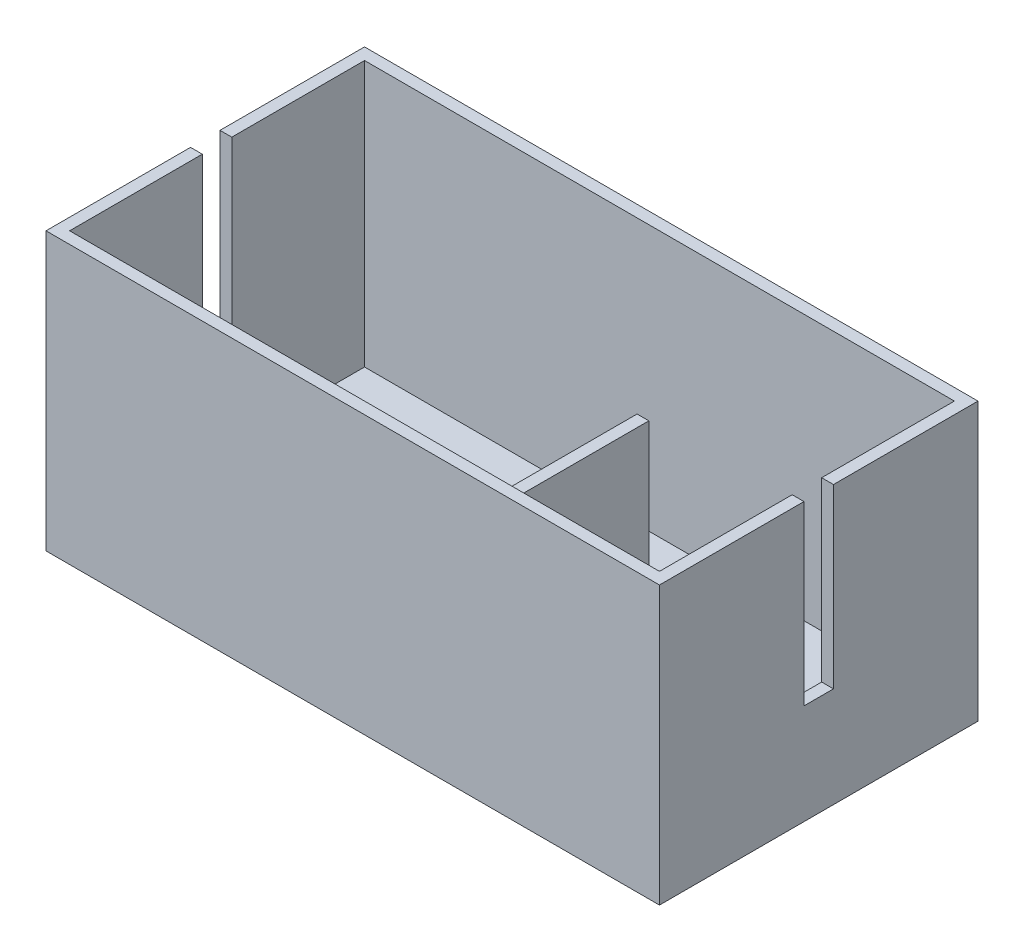
ISO-10303-21;
HEADER;
FILE_DESCRIPTION(('STEP AP214'),'2;1');
FILE_NAME('part.step','',(''),(''),'','','');
FILE_SCHEMA(('AUTOMOTIVE_DESIGN { 1 0 10303 214 1 1 1 1 }'));
ENDSEC;
DATA;
#1=APPLICATION_CONTEXT('core data for automotive mechanical design processes');
#2=APPLICATION_PROTOCOL_DEFINITION('international standard','automotive_design',2000,#1);
#3=PRODUCT_CONTEXT('',#1,'mechanical');
#4=PRODUCT('Part','Part','',(#3));
#5=PRODUCT_RELATED_PRODUCT_CATEGORY('part','',(#4));
#6=PRODUCT_DEFINITION_FORMATION('','',#4);
#7=PRODUCT_DEFINITION_CONTEXT('part definition',#1,'design');
#8=PRODUCT_DEFINITION('design','',#6,#7);
#9=PRODUCT_DEFINITION_SHAPE('','',#8);
#10=(LENGTH_UNIT() NAMED_UNIT(*) SI_UNIT(.MILLI.,.METRE.));
#11=(NAMED_UNIT(*) PLANE_ANGLE_UNIT() SI_UNIT($,.RADIAN.));
#12=(NAMED_UNIT(*) SI_UNIT($,.STERADIAN.) SOLID_ANGLE_UNIT());
#13=UNCERTAINTY_MEASURE_WITH_UNIT(LENGTH_MEASURE(1.E-05),#10,'distance_accuracy_value','');
#14=(GEOMETRIC_REPRESENTATION_CONTEXT(3) GLOBAL_UNCERTAINTY_ASSIGNED_CONTEXT((#13)) GLOBAL_UNIT_ASSIGNED_CONTEXT((#10,
#11,#12)) REPRESENTATION_CONTEXT('',''));
#15=CARTESIAN_POINT('',(0.,0.,0.));
#16=DIRECTION('',(0.,0.,1.));
#17=DIRECTION('',(1.,0.,0.));
#18=AXIS2_PLACEMENT_3D('',#15,#16,#17);
#19=CARTESIAN_POINT('',(-50.,45.,25.));
#20=DIRECTION('',(0.,0.,-1.));
#21=DIRECTION('',(-1.,0.,0.));
#22=AXIS2_PLACEMENT_3D('',#19,#20,#21);
#23=PLANE('',#22);
#24=DIRECTION('',(1.,0.,0.));
#25=VECTOR('',#24,1.);
#26=CARTESIAN_POINT('',(20.,40.,25.));
#27=LINE('',#26,#25);
#28=CARTESIAN_POINT('',(20.,40.,25.));
#29=VERTEX_POINT('',#28);
#30=CARTESIAN_POINT('',(22.,40.,25.));
#31=VERTEX_POINT('',#30);
#32=EDGE_CURVE('E48',#29,#31,#27,.T.);
#33=ORIENTED_EDGE('',*,*,#32,.F.);
#34=DIRECTION('',(0.,-1.,0.));
#35=VECTOR('',#34,1.);
#36=CARTESIAN_POINT('',(20.,40.,25.));
#37=LINE('',#36,#35);
#38=CARTESIAN_POINT('',(20.,0.,25.));
#39=VERTEX_POINT('',#38);
#40=EDGE_CURVE('E199',#29,#39,#37,.T.);
#41=ORIENTED_EDGE('',*,*,#40,.T.);
#42=DIRECTION('',(1.,0.,0.));
#43=VECTOR('',#42,1.);
#44=CARTESIAN_POINT('',(-50.,0.,25.));
#45=LINE('',#44,#43);
#46=CARTESIAN_POINT('',(-50.,0.,25.));
#47=VERTEX_POINT('',#46);
#48=EDGE_CURVE('E284',#47,#39,#45,.T.);
#49=ORIENTED_EDGE('',*,*,#48,.F.);
#50=DIRECTION('',(0.,-1.,0.));
#51=VECTOR('',#50,1.);
#52=CARTESIAN_POINT('',(-50.,45.,25.));
#53=LINE('',#52,#51);
#54=CARTESIAN_POINT('',(-50.,45.,25.));
#55=VERTEX_POINT('',#54);
#56=EDGE_CURVE('E289',#55,#47,#53,.T.);
#57=ORIENTED_EDGE('',*,*,#56,.F.);
#58=DIRECTION('',(1.,0.,0.));
#59=VECTOR('',#58,1.);
#60=CARTESIAN_POINT('',(-50.,45.,25.));
#61=LINE('',#60,#59);
#62=CARTESIAN_POINT('',(50.,45.,25.));
#63=VERTEX_POINT('',#62);
#64=EDGE_CURVE('E272',#55,#63,#61,.T.);
#65=ORIENTED_EDGE('',*,*,#64,.T.);
#66=DIRECTION('',(0.,-1.,0.));
#67=VECTOR('',#66,1.);
#68=CARTESIAN_POINT('',(50.,45.,25.));
#69=LINE('',#68,#67);
#70=CARTESIAN_POINT('',(50.,0.,25.));
#71=VERTEX_POINT('',#70);
#72=EDGE_CURVE('E274',#63,#71,#69,.T.);
#73=ORIENTED_EDGE('',*,*,#72,.T.);
#74=CARTESIAN_POINT('',(22.,0.,25.));
#75=VERTEX_POINT('',#74);
#76=EDGE_CURVE('E283',#75,#71,#45,.T.);
#77=ORIENTED_EDGE('',*,*,#76,.F.);
#78=DIRECTION('',(0.,-1.,0.));
#79=VECTOR('',#78,1.);
#80=CARTESIAN_POINT('',(22.,40.,25.));
#81=LINE('',#80,#79);
#82=EDGE_CURVE('E53',#31,#75,#81,.T.);
#83=ORIENTED_EDGE('',*,*,#82,.F.);
#84=EDGE_LOOP('',(#33,#41,#49,#57,#65,#73,#77,#83));
#85=FACE_BOUND('',#84,.T.);
#86=ADVANCED_FACE('F33',(#85),#23,.T.);
#87=CARTESIAN_POINT('',(0.,0.,0.));
#88=DIRECTION('',(0.,-1.,0.));
#89=DIRECTION('',(0.,0.,-1.));
#90=AXIS2_PLACEMENT_3D('',#87,#88,#89);
#91=PLANE('',#90);
#92=DIRECTION('',(0.,0.,1.));
#93=VECTOR('',#92,1.);
#94=CARTESIAN_POINT('',(20.,0.,25.));
#95=LINE('',#94,#93);
#96=CARTESIAN_POINT('',(20.,0.,-1.20124084731858));
#97=VERTEX_POINT('',#96);
#98=EDGE_CURVE('E191',#97,#39,#95,.T.);
#99=ORIENTED_EDGE('',*,*,#98,.F.);
#100=DIRECTION('',(-1.,0.,0.));
#101=VECTOR('',#100,1.);
#102=CARTESIAN_POINT('',(20.,0.,-1.20124084731858));
#103=LINE('',#102,#101);
#104=CARTESIAN_POINT('',(22.,0.,-1.20124084731858));
#105=VERTEX_POINT('',#104);
#106=EDGE_CURVE('E195',#105,#97,#103,.T.);
#107=ORIENTED_EDGE('',*,*,#106,.F.);
#108=DIRECTION('',(0.,0.,-1.));
#109=VECTOR('',#108,1.);
#110=CARTESIAN_POINT('',(22.,0.,25.));
#111=LINE('',#110,#109);
#112=EDGE_CURVE('E179',#75,#105,#111,.T.);
#113=ORIENTED_EDGE('',*,*,#112,.F.);
#114=ORIENTED_EDGE('',*,*,#76,.T.);
#115=DIRECTION('',(0.,0.,-1.));
#116=VECTOR('',#115,1.);
#117=CARTESIAN_POINT('',(50.,0.,-25.));
#118=LINE('',#117,#116);
#119=CARTESIAN_POINT('',(50.,0.,-25.));
#120=VERTEX_POINT('',#119);
#121=EDGE_CURVE('E261',#71,#120,#118,.T.);
#122=ORIENTED_EDGE('',*,*,#121,.T.);
#123=DIRECTION('',(-1.,0.,0.));
#124=VECTOR('',#123,1.);
#125=CARTESIAN_POINT('',(-50.,0.,-25.));
#126=LINE('',#125,#124);
#127=CARTESIAN_POINT('',(-50.,0.,-25.));
#128=VERTEX_POINT('',#127);
#129=EDGE_CURVE('E277',#120,#128,#126,.T.);
#130=ORIENTED_EDGE('',*,*,#129,.T.);
#131=DIRECTION('',(0.,0.,1.));
#132=VECTOR('',#131,1.);
#133=CARTESIAN_POINT('',(-50.,0.,-25.));
#134=LINE('',#133,#132);
#135=EDGE_CURVE('E280',#128,#47,#134,.T.);
#136=ORIENTED_EDGE('',*,*,#135,.T.);
#137=ORIENTED_EDGE('',*,*,#48,.T.);
#138=EDGE_LOOP('',(#99,#107,#113,#114,#122,#130,#136,#137));
#139=FACE_BOUND('',#138,.T.);
#140=ADVANCED_FACE('F383',(#139),#91,.F.);
#141=CARTESIAN_POINT('',(0.,45.,0.));
#142=DIRECTION('',(0.,1.,0.));
#143=DIRECTION('',(0.,0.,1.));
#144=AXIS2_PLACEMENT_3D('',#141,#142,#143);
#145=PLANE('',#144);
#146=DIRECTION('',(-1.,0.,0.));
#147=VECTOR('',#146,1.);
#148=CARTESIAN_POINT('',(52.,45.,-2.5));
#149=LINE('',#148,#147);
#150=CARTESIAN_POINT('',(52.,45.,-2.5));
#151=VERTEX_POINT('',#150);
#152=CARTESIAN_POINT('',(50.,45.,-2.5));
#153=VERTEX_POINT('',#152);
#154=EDGE_CURVE('E206',#151,#153,#149,.T.);
#155=ORIENTED_EDGE('',*,*,#154,.F.);
#156=DIRECTION('',(0.,0.,-1.));
#157=VECTOR('',#156,1.);
#158=CARTESIAN_POINT('',(52.,45.,-27.));
#159=LINE('',#158,#157);
#160=CARTESIAN_POINT('',(52.,45.,-27.));
#161=VERTEX_POINT('',#160);
#162=EDGE_CURVE('E296',#151,#161,#159,.T.);
#163=ORIENTED_EDGE('',*,*,#162,.T.);
#164=DIRECTION('',(-1.,0.,0.));
#165=VECTOR('',#164,1.);
#166=CARTESIAN_POINT('',(-52.,45.,-27.));
#167=LINE('',#166,#165);
#168=CARTESIAN_POINT('',(-52.,45.,-27.));
#169=VERTEX_POINT('',#168);
#170=EDGE_CURVE('E300',#161,#169,#167,.T.);
#171=ORIENTED_EDGE('',*,*,#170,.T.);
#172=DIRECTION('',(0.,0.,1.));
#173=VECTOR('',#172,1.);
#174=CARTESIAN_POINT('',(-52.,45.,-27.));
#175=LINE('',#174,#173);
#176=CARTESIAN_POINT('',(-52.,45.,-2.50000000000001));
#177=VERTEX_POINT('',#176);
#178=EDGE_CURVE('E303',#169,#177,#175,.T.);
#179=ORIENTED_EDGE('',*,*,#178,.T.);
#180=DIRECTION('',(-1.,0.,0.));
#181=VECTOR('',#180,1.);
#182=CARTESIAN_POINT('',(-50.,45.,-2.5));
#183=LINE('',#182,#181);
#184=CARTESIAN_POINT('',(-50.,45.,-2.5));
#185=VERTEX_POINT('',#184);
#186=EDGE_CURVE('E232',#185,#177,#183,.T.);
#187=ORIENTED_EDGE('',*,*,#186,.F.);
#188=DIRECTION('',(0.,0.,1.));
#189=VECTOR('',#188,1.);
#190=CARTESIAN_POINT('',(-50.,45.,-25.));
#191=LINE('',#190,#189);
#192=CARTESIAN_POINT('',(-50.,45.,-25.));
#193=VERTEX_POINT('',#192);
#194=EDGE_CURVE('E269',#193,#185,#191,.T.);
#195=ORIENTED_EDGE('',*,*,#194,.F.);
#196=DIRECTION('',(-1.,0.,0.));
#197=VECTOR('',#196,1.);
#198=CARTESIAN_POINT('',(-50.,45.,-25.));
#199=LINE('',#198,#197);
#200=CARTESIAN_POINT('',(50.,45.,-25.));
#201=VERTEX_POINT('',#200);
#202=EDGE_CURVE('E265',#201,#193,#199,.T.);
#203=ORIENTED_EDGE('',*,*,#202,.F.);
#204=DIRECTION('',(0.,0.,-1.));
#205=VECTOR('',#204,1.);
#206=CARTESIAN_POINT('',(50.,45.,-25.));
#207=LINE('',#206,#205);
#208=EDGE_CURVE('E266',#153,#201,#207,.T.);
#209=ORIENTED_EDGE('',*,*,#208,.F.);
#210=EDGE_LOOP('',(#155,#163,#171,#179,#187,#195,#203,#209));
#211=FACE_BOUND('',#210,.T.);
#212=ADVANCED_FACE('F359',(#211),#145,.T.);
#213=DIRECTION('',(1.,0.,0.));
#214=VECTOR('',#213,1.);
#215=CARTESIAN_POINT('',(52.,45.,2.5));
#216=LINE('',#215,#214);
#217=CARTESIAN_POINT('',(50.,45.,2.5));
#218=VERTEX_POINT('',#217);
#219=CARTESIAN_POINT('',(52.,45.,2.5));
#220=VERTEX_POINT('',#219);
#221=EDGE_CURVE('E214',#218,#220,#216,.T.);
#222=ORIENTED_EDGE('',*,*,#221,.F.);
#223=EDGE_CURVE('E262',#63,#218,#207,.T.);
#224=ORIENTED_EDGE('',*,*,#223,.F.);
#225=ORIENTED_EDGE('',*,*,#64,.F.);
#226=CARTESIAN_POINT('',(-50.,45.,2.5));
#227=VERTEX_POINT('',#226);
#228=EDGE_CURVE('E268',#227,#55,#191,.T.);
#229=ORIENTED_EDGE('',*,*,#228,.F.);
#230=DIRECTION('',(1.,0.,0.));
#231=VECTOR('',#230,1.);
#232=CARTESIAN_POINT('',(-50.,45.,2.5));
#233=LINE('',#232,#231);
#234=CARTESIAN_POINT('',(-52.,45.,2.5));
#235=VERTEX_POINT('',#234);
#236=EDGE_CURVE('E201',#235,#227,#233,.T.);
#237=ORIENTED_EDGE('',*,*,#236,.F.);
#238=CARTESIAN_POINT('',(-52.,45.,27.));
#239=VERTEX_POINT('',#238);
#240=EDGE_CURVE('E302',#235,#239,#175,.T.);
#241=ORIENTED_EDGE('',*,*,#240,.T.);
#242=DIRECTION('',(1.,0.,0.));
#243=VECTOR('',#242,1.);
#244=CARTESIAN_POINT('',(-52.,45.,27.));
#245=LINE('',#244,#243);
#246=CARTESIAN_POINT('',(52.,45.,27.));
#247=VERTEX_POINT('',#246);
#248=EDGE_CURVE('E306',#239,#247,#245,.T.);
#249=ORIENTED_EDGE('',*,*,#248,.T.);
#250=EDGE_CURVE('E297',#247,#220,#159,.T.);
#251=ORIENTED_EDGE('',*,*,#250,.T.);
#252=EDGE_LOOP('',(#222,#224,#225,#229,#237,#241,#249,#251));
#253=FACE_BOUND('',#252,.T.);
#254=ADVANCED_FACE('F340',(#253),#145,.T.);
#255=CARTESIAN_POINT('',(52.,45.,-27.));
#256=DIRECTION('',(-1.,0.,0.));
#257=DIRECTION('',(0.,0.,1.));
#258=AXIS2_PLACEMENT_3D('',#255,#256,#257);
#259=PLANE('',#258);
#260=ORIENTED_EDGE('',*,*,#162,.F.);
#261=DIRECTION('',(0.,1.,0.));
#262=VECTOR('',#261,1.);
#263=CARTESIAN_POINT('',(52.,15.,-2.5));
#264=LINE('',#263,#262);
#265=CARTESIAN_POINT('',(52.,15.,-2.5));
#266=VERTEX_POINT('',#265);
#267=EDGE_CURVE('E222',#266,#151,#264,.T.);
#268=ORIENTED_EDGE('',*,*,#267,.F.);
#269=DIRECTION('',(0.,0.,-1.));
#270=VECTOR('',#269,1.);
#271=CARTESIAN_POINT('',(52.,15.,2.5));
#272=LINE('',#271,#270);
#273=CARTESIAN_POINT('',(52.,15.,2.5));
#274=VERTEX_POINT('',#273);
#275=EDGE_CURVE('E209',#274,#266,#272,.T.);
#276=ORIENTED_EDGE('',*,*,#275,.F.);
#277=DIRECTION('',(0.,1.,0.));
#278=VECTOR('',#277,1.);
#279=CARTESIAN_POINT('',(52.,15.,2.5));
#280=LINE('',#279,#278);
#281=EDGE_CURVE('E224',#274,#220,#280,.T.);
#282=ORIENTED_EDGE('',*,*,#281,.T.);
#283=ORIENTED_EDGE('',*,*,#250,.F.);
#284=DIRECTION('',(0.,-1.,0.));
#285=VECTOR('',#284,1.);
#286=CARTESIAN_POINT('',(52.,45.,27.));
#287=LINE('',#286,#285);
#288=CARTESIAN_POINT('',(52.,-2.,27.));
#289=VERTEX_POINT('',#288);
#290=EDGE_CURVE('E308',#247,#289,#287,.T.);
#291=ORIENTED_EDGE('',*,*,#290,.T.);
#292=DIRECTION('',(0.,0.,-1.));
#293=VECTOR('',#292,1.);
#294=CARTESIAN_POINT('',(52.,-2.,27.));
#295=LINE('',#294,#293);
#296=CARTESIAN_POINT('',(52.,-2.,-27.));
#297=VERTEX_POINT('',#296);
#298=EDGE_CURVE('E221',#289,#297,#295,.T.);
#299=ORIENTED_EDGE('',*,*,#298,.T.);
#300=DIRECTION('',(0.,-1.,0.));
#301=VECTOR('',#300,1.);
#302=CARTESIAN_POINT('',(52.,45.,-27.));
#303=LINE('',#302,#301);
#304=EDGE_CURVE('E11',#161,#297,#303,.T.);
#305=ORIENTED_EDGE('',*,*,#304,.F.);
#306=EDGE_LOOP('',(#260,#268,#276,#282,#283,#291,#299,#305));
#307=FACE_BOUND('',#306,.T.);
#308=ADVANCED_FACE('F35',(#307),#259,.F.);
#309=CARTESIAN_POINT('',(-52.,45.,-27.));
#310=DIRECTION('',(0.,0.,1.));
#311=DIRECTION('',(1.,0.,0.));
#312=AXIS2_PLACEMENT_3D('',#309,#310,#311);
#313=PLANE('',#312);
#314=ORIENTED_EDGE('',*,*,#304,.T.);
#315=DIRECTION('',(-1.,0.,0.));
#316=VECTOR('',#315,1.);
#317=CARTESIAN_POINT('',(-52.,-2.,-27.));
#318=LINE('',#317,#316);
#319=CARTESIAN_POINT('',(-52.,-2.,-27.));
#320=VERTEX_POINT('',#319);
#321=EDGE_CURVE('E252',#297,#320,#318,.T.);
#322=ORIENTED_EDGE('',*,*,#321,.T.);
#323=DIRECTION('',(0.,-1.,0.));
#324=VECTOR('',#323,1.);
#325=CARTESIAN_POINT('',(-52.,45.,-27.));
#326=LINE('',#325,#324);
#327=EDGE_CURVE('E41',#169,#320,#326,.T.);
#328=ORIENTED_EDGE('',*,*,#327,.F.);
#329=ORIENTED_EDGE('',*,*,#170,.F.);
#330=EDGE_LOOP('',(#314,#322,#328,#329));
#331=FACE_BOUND('',#330,.T.);
#332=ADVANCED_FACE('F325',(#331),#313,.F.);
#333=CARTESIAN_POINT('',(-52.,45.,-27.));
#334=DIRECTION('',(1.,0.,0.));
#335=DIRECTION('',(0.,0.,-1.));
#336=AXIS2_PLACEMENT_3D('',#333,#334,#335);
#337=PLANE('',#336);
#338=DIRECTION('',(0.,0.,1.));
#339=VECTOR('',#338,1.);
#340=CARTESIAN_POINT('',(-52.,15.,2.5));
#341=LINE('',#340,#339);
#342=CARTESIAN_POINT('',(-52.,15.,-2.50000000000001));
#343=VERTEX_POINT('',#342);
#344=CARTESIAN_POINT('',(-52.,15.,2.5));
#345=VERTEX_POINT('',#344);
#346=EDGE_CURVE('E228',#343,#345,#341,.T.);
#347=ORIENTED_EDGE('',*,*,#346,.F.);
#348=DIRECTION('',(0.,1.,0.));
#349=VECTOR('',#348,1.);
#350=CARTESIAN_POINT('',(-52.,15.,-2.50000000000001));
#351=LINE('',#350,#349);
#352=EDGE_CURVE('E216',#343,#177,#351,.T.);
#353=ORIENTED_EDGE('',*,*,#352,.T.);
#354=ORIENTED_EDGE('',*,*,#178,.F.);
#355=ORIENTED_EDGE('',*,*,#327,.T.);
#356=DIRECTION('',(0.,0.,1.));
#357=VECTOR('',#356,1.);
#358=CARTESIAN_POINT('',(-52.,-2.,27.));
#359=LINE('',#358,#357);
#360=CARTESIAN_POINT('',(-52.,-2.,27.));
#361=VERTEX_POINT('',#360);
#362=EDGE_CURVE('E255',#320,#361,#359,.T.);
#363=ORIENTED_EDGE('',*,*,#362,.T.);
#364=DIRECTION('',(0.,-1.,0.));
#365=VECTOR('',#364,1.);
#366=CARTESIAN_POINT('',(-52.,45.,27.));
#367=LINE('',#366,#365);
#368=EDGE_CURVE('E310',#239,#361,#367,.T.);
#369=ORIENTED_EDGE('',*,*,#368,.F.);
#370=ORIENTED_EDGE('',*,*,#240,.F.);
#371=DIRECTION('',(0.,1.,0.));
#372=VECTOR('',#371,1.);
#373=CARTESIAN_POINT('',(-52.,15.,2.5));
#374=LINE('',#373,#372);
#375=EDGE_CURVE('E239',#345,#235,#374,.T.);
#376=ORIENTED_EDGE('',*,*,#375,.F.);
#377=EDGE_LOOP('',(#347,#353,#354,#355,#363,#369,#370,#376));
#378=FACE_BOUND('',#377,.T.);
#379=ADVANCED_FACE('F316',(#378),#337,.F.);
#380=CARTESIAN_POINT('',(-52.,45.,27.));
#381=DIRECTION('',(0.,0.,-1.));
#382=DIRECTION('',(-1.,0.,0.));
#383=AXIS2_PLACEMENT_3D('',#380,#381,#382);
#384=PLANE('',#383);
#385=ORIENTED_EDGE('',*,*,#368,.T.);
#386=DIRECTION('',(1.,0.,0.));
#387=VECTOR('',#386,1.);
#388=CARTESIAN_POINT('',(-52.,-2.,27.));
#389=LINE('',#388,#387);
#390=EDGE_CURVE('E258',#361,#289,#389,.T.);
#391=ORIENTED_EDGE('',*,*,#390,.T.);
#392=ORIENTED_EDGE('',*,*,#290,.F.);
#393=ORIENTED_EDGE('',*,*,#248,.F.);
#394=EDGE_LOOP('',(#385,#391,#392,#393));
#395=FACE_BOUND('',#394,.T.);
#396=ADVANCED_FACE('F333',(#395),#384,.F.);
#397=CARTESIAN_POINT('',(50.,45.,-25.));
#398=DIRECTION('',(-1.,0.,0.));
#399=DIRECTION('',(0.,0.,1.));
#400=AXIS2_PLACEMENT_3D('',#397,#398,#399);
#401=PLANE('',#400);
#402=DIRECTION('',(0.,1.,0.));
#403=VECTOR('',#402,1.);
#404=CARTESIAN_POINT('',(50.,15.,-2.5));
#405=LINE('',#404,#403);
#406=CARTESIAN_POINT('',(50.,15.,-2.5));
#407=VERTEX_POINT('',#406);
#408=EDGE_CURVE('E218',#407,#153,#405,.T.);
#409=ORIENTED_EDGE('',*,*,#408,.T.);
#410=ORIENTED_EDGE('',*,*,#208,.T.);
#411=DIRECTION('',(0.,-1.,0.));
#412=VECTOR('',#411,1.);
#413=CARTESIAN_POINT('',(50.,45.,-25.));
#414=LINE('',#413,#412);
#415=EDGE_CURVE('E293',#201,#120,#414,.T.);
#416=ORIENTED_EDGE('',*,*,#415,.T.);
#417=ORIENTED_EDGE('',*,*,#121,.F.);
#418=ORIENTED_EDGE('',*,*,#72,.F.);
#419=ORIENTED_EDGE('',*,*,#223,.T.);
#420=DIRECTION('',(0.,1.,0.));
#421=VECTOR('',#420,1.);
#422=CARTESIAN_POINT('',(50.,15.,2.5));
#423=LINE('',#422,#421);
#424=CARTESIAN_POINT('',(50.,15.,2.5));
#425=VERTEX_POINT('',#424);
#426=EDGE_CURVE('E213',#425,#218,#423,.T.);
#427=ORIENTED_EDGE('',*,*,#426,.F.);
#428=DIRECTION('',(0.,0.,1.));
#429=VECTOR('',#428,1.);
#430=CARTESIAN_POINT('',(50.,15.,2.5));
#431=LINE('',#430,#429);
#432=EDGE_CURVE('E202',#407,#425,#431,.T.);
#433=ORIENTED_EDGE('',*,*,#432,.F.);
#434=EDGE_LOOP('',(#409,#410,#416,#417,#418,#419,#427,#433));
#435=FACE_BOUND('',#434,.T.);
#436=ADVANCED_FACE('F369',(#435),#401,.T.);
#437=CARTESIAN_POINT('',(-50.,45.,-25.));
#438=DIRECTION('',(0.,0.,1.));
#439=DIRECTION('',(1.,0.,0.));
#440=AXIS2_PLACEMENT_3D('',#437,#438,#439);
#441=PLANE('',#440);
#442=ORIENTED_EDGE('',*,*,#129,.F.);
#443=ORIENTED_EDGE('',*,*,#415,.F.);
#444=ORIENTED_EDGE('',*,*,#202,.T.);
#445=DIRECTION('',(0.,-1.,0.));
#446=VECTOR('',#445,1.);
#447=CARTESIAN_POINT('',(-50.,45.,-25.));
#448=LINE('',#447,#446);
#449=EDGE_CURVE('E291',#193,#128,#448,.T.);
#450=ORIENTED_EDGE('',*,*,#449,.T.);
#451=EDGE_LOOP('',(#442,#443,#444,#450));
#452=FACE_BOUND('',#451,.T.);
#453=ADVANCED_FACE('F385',(#452),#441,.T.);
#454=CARTESIAN_POINT('',(-50.,45.,-25.));
#455=DIRECTION('',(1.,0.,0.));
#456=DIRECTION('',(0.,0.,-1.));
#457=AXIS2_PLACEMENT_3D('',#454,#455,#456);
#458=PLANE('',#457);
#459=DIRECTION('',(0.,1.,0.));
#460=VECTOR('',#459,1.);
#461=CARTESIAN_POINT('',(-50.,15.,-2.5));
#462=LINE('',#461,#460);
#463=CARTESIAN_POINT('',(-50.,15.,-2.5));
#464=VERTEX_POINT('',#463);
#465=EDGE_CURVE('E244',#464,#185,#462,.T.);
#466=ORIENTED_EDGE('',*,*,#465,.F.);
#467=DIRECTION('',(0.,0.,-1.));
#468=VECTOR('',#467,1.);
#469=CARTESIAN_POINT('',(-50.,15.,2.5));
#470=LINE('',#469,#468);
#471=CARTESIAN_POINT('',(-50.,15.,2.5));
#472=VERTEX_POINT('',#471);
#473=EDGE_CURVE('E234',#472,#464,#470,.T.);
#474=ORIENTED_EDGE('',*,*,#473,.F.);
#475=DIRECTION('',(0.,1.,0.));
#476=VECTOR('',#475,1.);
#477=CARTESIAN_POINT('',(-50.,15.,2.5));
#478=LINE('',#477,#476);
#479=EDGE_CURVE('E246',#472,#227,#478,.T.);
#480=ORIENTED_EDGE('',*,*,#479,.T.);
#481=ORIENTED_EDGE('',*,*,#228,.T.);
#482=ORIENTED_EDGE('',*,*,#56,.T.);
#483=ORIENTED_EDGE('',*,*,#135,.F.);
#484=ORIENTED_EDGE('',*,*,#449,.F.);
#485=ORIENTED_EDGE('',*,*,#194,.T.);
#486=EDGE_LOOP('',(#466,#474,#480,#481,#482,#483,#484,#485));
#487=FACE_BOUND('',#486,.T.);
#488=ADVANCED_FACE('F349',(#487),#458,.T.);
#489=CARTESIAN_POINT('',(0.,-2.,0.));
#490=DIRECTION('',(0.,-1.,0.));
#491=DIRECTION('',(0.,0.,-1.));
#492=AXIS2_PLACEMENT_3D('',#489,#490,#491);
#493=PLANE('',#492);
#494=ORIENTED_EDGE('',*,*,#298,.F.);
#495=ORIENTED_EDGE('',*,*,#390,.F.);
#496=ORIENTED_EDGE('',*,*,#362,.F.);
#497=ORIENTED_EDGE('',*,*,#321,.F.);
#498=EDGE_LOOP('',(#494,#495,#496,#497));
#499=FACE_BOUND('',#498,.T.);
#500=ADVANCED_FACE('F324',(#499),#493,.T.);
#501=CARTESIAN_POINT('',(-50.,15.,-2.5));
#502=DIRECTION('',(0.,0.,-1.));
#503=DIRECTION('',(-1.,0.,0.));
#504=AXIS2_PLACEMENT_3D('',#501,#502,#503);
#505=PLANE('',#504);
#506=ORIENTED_EDGE('',*,*,#186,.T.);
#507=ORIENTED_EDGE('',*,*,#352,.F.);
#508=DIRECTION('',(-1.,0.,0.));
#509=VECTOR('',#508,1.);
#510=CARTESIAN_POINT('',(-50.,15.,-2.5));
#511=LINE('',#510,#509);
#512=EDGE_CURVE('E236',#464,#343,#511,.T.);
#513=ORIENTED_EDGE('',*,*,#512,.F.);
#514=ORIENTED_EDGE('',*,*,#465,.T.);
#515=EDGE_LOOP('',(#506,#507,#513,#514));
#516=FACE_BOUND('',#515,.T.);
#517=ADVANCED_FACE('F355',(#516),#505,.F.);
#518=CARTESIAN_POINT('',(-50.,15.,2.5));
#519=DIRECTION('',(0.,0.,1.));
#520=DIRECTION('',(1.,0.,0.));
#521=AXIS2_PLACEMENT_3D('',#518,#519,#520);
#522=PLANE('',#521);
#523=ORIENTED_EDGE('',*,*,#236,.T.);
#524=ORIENTED_EDGE('',*,*,#479,.F.);
#525=DIRECTION('',(1.,0.,0.));
#526=VECTOR('',#525,1.);
#527=CARTESIAN_POINT('',(-50.,15.,2.5));
#528=LINE('',#527,#526);
#529=EDGE_CURVE('E231',#345,#472,#528,.T.);
#530=ORIENTED_EDGE('',*,*,#529,.F.);
#531=ORIENTED_EDGE('',*,*,#375,.T.);
#532=EDGE_LOOP('',(#523,#524,#530,#531));
#533=FACE_BOUND('',#532,.T.);
#534=ADVANCED_FACE('F345',(#533),#522,.F.);
#535=CARTESIAN_POINT('',(0.,15.,0.));
#536=DIRECTION('',(0.,1.,0.));
#537=DIRECTION('',(0.,0.,1.));
#538=AXIS2_PLACEMENT_3D('',#535,#536,#537);
#539=PLANE('',#538);
#540=ORIENTED_EDGE('',*,*,#346,.T.);
#541=ORIENTED_EDGE('',*,*,#529,.T.);
#542=ORIENTED_EDGE('',*,*,#473,.T.);
#543=ORIENTED_EDGE('',*,*,#512,.T.);
#544=EDGE_LOOP('',(#540,#541,#542,#543));
#545=FACE_BOUND('',#544,.T.);
#546=ADVANCED_FACE('F353',(#545),#539,.T.);
#547=CARTESIAN_POINT('',(52.,15.,-2.5));
#548=DIRECTION('',(0.,0.,-1.));
#549=DIRECTION('',(-1.,0.,0.));
#550=AXIS2_PLACEMENT_3D('',#547,#548,#549);
#551=PLANE('',#550);
#552=ORIENTED_EDGE('',*,*,#154,.T.);
#553=ORIENTED_EDGE('',*,*,#408,.F.);
#554=DIRECTION('',(-1.,0.,0.));
#555=VECTOR('',#554,1.);
#556=CARTESIAN_POINT('',(52.,15.,-2.5));
#557=LINE('',#556,#555);
#558=EDGE_CURVE('E211',#266,#407,#557,.T.);
#559=ORIENTED_EDGE('',*,*,#558,.F.);
#560=ORIENTED_EDGE('',*,*,#267,.T.);
#561=EDGE_LOOP('',(#552,#553,#559,#560));
#562=FACE_BOUND('',#561,.T.);
#563=ADVANCED_FACE('F365',(#562),#551,.F.);
#564=CARTESIAN_POINT('',(52.,15.,2.5));
#565=DIRECTION('',(0.,0.,1.));
#566=DIRECTION('',(1.,0.,0.));
#567=AXIS2_PLACEMENT_3D('',#564,#565,#566);
#568=PLANE('',#567);
#569=ORIENTED_EDGE('',*,*,#221,.T.);
#570=ORIENTED_EDGE('',*,*,#281,.F.);
#571=DIRECTION('',(1.,0.,0.));
#572=VECTOR('',#571,1.);
#573=CARTESIAN_POINT('',(52.,15.,2.5));
#574=LINE('',#573,#572);
#575=EDGE_CURVE('E205',#425,#274,#574,.T.);
#576=ORIENTED_EDGE('',*,*,#575,.F.);
#577=ORIENTED_EDGE('',*,*,#426,.T.);
#578=EDGE_LOOP('',(#569,#570,#576,#577));
#579=FACE_BOUND('',#578,.T.);
#580=ADVANCED_FACE('F409',(#579),#568,.F.);
#581=CARTESIAN_POINT('',(0.,15.,0.));
#582=DIRECTION('',(0.,1.,0.));
#583=DIRECTION('',(0.,0.,1.));
#584=AXIS2_PLACEMENT_3D('',#581,#582,#583);
#585=PLANE('',#584);
#586=ORIENTED_EDGE('',*,*,#432,.T.);
#587=ORIENTED_EDGE('',*,*,#575,.T.);
#588=ORIENTED_EDGE('',*,*,#275,.T.);
#589=ORIENTED_EDGE('',*,*,#558,.T.);
#590=EDGE_LOOP('',(#586,#587,#588,#589));
#591=FACE_BOUND('',#590,.T.);
#592=ADVANCED_FACE('F373',(#591),#585,.T.);
#593=CARTESIAN_POINT('',(20.,40.,25.));
#594=DIRECTION('',(1.,0.,0.));
#595=DIRECTION('',(0.,0.,-1.));
#596=AXIS2_PLACEMENT_3D('',#593,#594,#595);
#597=PLANE('',#596);
#598=ORIENTED_EDGE('',*,*,#98,.T.);
#599=ORIENTED_EDGE('',*,*,#40,.F.);
#600=DIRECTION('',(0.,0.,1.));
#601=VECTOR('',#600,1.);
#602=CARTESIAN_POINT('',(20.,40.,25.));
#603=LINE('',#602,#601);
#604=CARTESIAN_POINT('',(20.,40.,-1.20124084731858));
#605=VERTEX_POINT('',#604);
#606=EDGE_CURVE('E196',#605,#29,#603,.T.);
#607=ORIENTED_EDGE('',*,*,#606,.F.);
#608=DIRECTION('',(0.,-1.,0.));
#609=VECTOR('',#608,1.);
#610=CARTESIAN_POINT('',(20.,40.,-1.20124084731858));
#611=LINE('',#610,#609);
#612=EDGE_CURVE('E182',#605,#97,#611,.T.);
#613=ORIENTED_EDGE('',*,*,#612,.T.);
#614=EDGE_LOOP('',(#598,#599,#607,#613));
#615=FACE_BOUND('',#614,.T.);
#616=ADVANCED_FACE('F416',(#615),#597,.F.);
#617=CARTESIAN_POINT('',(22.,40.,25.));
#618=DIRECTION('',(-1.,0.,0.));
#619=DIRECTION('',(0.,0.,1.));
#620=AXIS2_PLACEMENT_3D('',#617,#618,#619);
#621=PLANE('',#620);
#622=ORIENTED_EDGE('',*,*,#112,.T.);
#623=DIRECTION('',(0.,-1.,0.));
#624=VECTOR('',#623,1.);
#625=CARTESIAN_POINT('',(22.,40.,-1.20124084731858));
#626=LINE('',#625,#624);
#627=CARTESIAN_POINT('',(22.,40.,-1.20124084731858));
#628=VERTEX_POINT('',#627);
#629=EDGE_CURVE('E177',#628,#105,#626,.T.);
#630=ORIENTED_EDGE('',*,*,#629,.F.);
#631=DIRECTION('',(0.,0.,-1.));
#632=VECTOR('',#631,1.);
#633=CARTESIAN_POINT('',(22.,40.,25.));
#634=LINE('',#633,#632);
#635=EDGE_CURVE('E167',#31,#628,#634,.T.);
#636=ORIENTED_EDGE('',*,*,#635,.F.);
#637=ORIENTED_EDGE('',*,*,#82,.T.);
#638=EDGE_LOOP('',(#622,#630,#636,#637));
#639=FACE_BOUND('',#638,.T.);
#640=ADVANCED_FACE('F178',(#639),#621,.F.);
#641=CARTESIAN_POINT('',(20.,40.,-1.20124084731858));
#642=DIRECTION('',(0.,0.,1.));
#643=DIRECTION('',(1.,0.,0.));
#644=AXIS2_PLACEMENT_3D('',#641,#642,#643);
#645=PLANE('',#644);
#646=ORIENTED_EDGE('',*,*,#106,.T.);
#647=ORIENTED_EDGE('',*,*,#612,.F.);
#648=DIRECTION('',(-1.,0.,0.));
#649=VECTOR('',#648,1.);
#650=CARTESIAN_POINT('',(20.,40.,-1.20124084731858));
#651=LINE('',#650,#649);
#652=EDGE_CURVE('E171',#628,#605,#651,.T.);
#653=ORIENTED_EDGE('',*,*,#652,.F.);
#654=ORIENTED_EDGE('',*,*,#629,.T.);
#655=EDGE_LOOP('',(#646,#647,#653,#654));
#656=FACE_BOUND('',#655,.T.);
#657=ADVANCED_FACE('F184',(#656),#645,.F.);
#658=CARTESIAN_POINT('',(0.,40.,0.));
#659=DIRECTION('',(0.,-1.,0.));
#660=DIRECTION('',(0.,0.,-1.));
#661=AXIS2_PLACEMENT_3D('',#658,#659,#660);
#662=PLANE('',#661);
#663=ORIENTED_EDGE('',*,*,#606,.T.);
#664=ORIENTED_EDGE('',*,*,#32,.T.);
#665=ORIENTED_EDGE('',*,*,#635,.T.);
#666=ORIENTED_EDGE('',*,*,#652,.T.);
#667=EDGE_LOOP('',(#663,#664,#665,#666));
#668=FACE_BOUND('',#667,.T.);
#669=ADVANCED_FACE('F169',(#668),#662,.F.);
#670=CLOSED_SHELL('',(#86,#140,#212,#254,#308,#332,#379,#396,#436,#453,#488,#500,#517,#534,#546,
#563,#580,#592,#616,#640,#657,#669));
#671=MANIFOLD_SOLID_BREP('B2',#670);
#672=ADVANCED_BREP_SHAPE_REPRESENTATION('',(#18,#671),#14);
#673=SHAPE_DEFINITION_REPRESENTATION(#9,#672);
ENDSEC;
END-ISO-10303-21;
